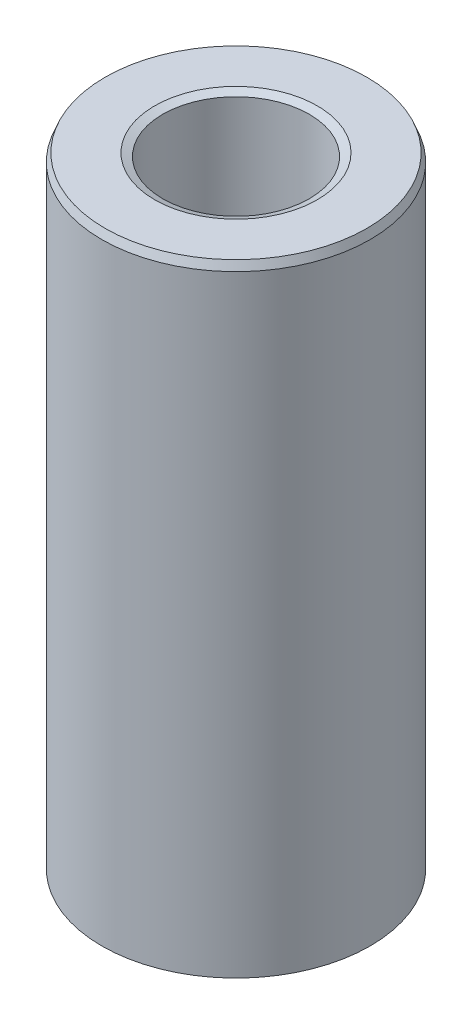
ISO-10303-21;
HEADER;
FILE_DESCRIPTION(('STEP AP214'),'2;1');
FILE_NAME('part.step','',(''),(''),'','','');
FILE_SCHEMA(('AUTOMOTIVE_DESIGN { 1 0 10303 214 1 1 1 1 }'));
ENDSEC;
DATA;
#1=APPLICATION_CONTEXT('core data for automotive mechanical design processes');
#2=APPLICATION_PROTOCOL_DEFINITION('international standard','automotive_design',2000,#1);
#3=PRODUCT_CONTEXT('',#1,'mechanical');
#4=PRODUCT('Part','Part','',(#3));
#5=PRODUCT_RELATED_PRODUCT_CATEGORY('part','',(#4));
#6=PRODUCT_DEFINITION_FORMATION('','',#4);
#7=PRODUCT_DEFINITION_CONTEXT('part definition',#1,'design');
#8=PRODUCT_DEFINITION('design','',#6,#7);
#9=PRODUCT_DEFINITION_SHAPE('','',#8);
#10=(LENGTH_UNIT() NAMED_UNIT(*) SI_UNIT(.MILLI.,.METRE.));
#11=(NAMED_UNIT(*) PLANE_ANGLE_UNIT() SI_UNIT($,.RADIAN.));
#12=(NAMED_UNIT(*) SI_UNIT($,.STERADIAN.) SOLID_ANGLE_UNIT());
#13=UNCERTAINTY_MEASURE_WITH_UNIT(LENGTH_MEASURE(1.E-05),#10,'distance_accuracy_value','');
#14=(GEOMETRIC_REPRESENTATION_CONTEXT(3) GLOBAL_UNCERTAINTY_ASSIGNED_CONTEXT((#13)) GLOBAL_UNIT_ASSIGNED_CONTEXT((#10,
#11,#12)) REPRESENTATION_CONTEXT('',''));
#15=CARTESIAN_POINT('',(0.,0.,0.));
#16=DIRECTION('',(0.,0.,1.));
#17=DIRECTION('',(1.,0.,0.));
#18=AXIS2_PLACEMENT_3D('',#15,#16,#17);
#19=CARTESIAN_POINT('',(0.,58.0610249584416,0.));
#20=DIRECTION('',(0.,-1.,0.));
#21=DIRECTION('',(0.,0.,-1.));
#22=AXIS2_PLACEMENT_3D('',#19,#20,#21);
#23=CYLINDRICAL_SURFACE('',#22,12.5);
#24=CARTESIAN_POINT('',(0.,0.300780208003594,0.));
#25=DIRECTION('',(0.,1.,0.));
#26=DIRECTION('',(0.,0.,1.));
#27=AXIS2_PLACEMENT_3D('',#24,#25,#26);
#28=CIRCLE('',#27,12.5);
#29=CARTESIAN_POINT('',(0.,0.300780208003587,-12.5));
#30=VERTEX_POINT('',#29);
#31=EDGE_CURVE('E10',#30,#30,#28,.T.);
#32=CARTESIAN_POINT('',(0.,57.3058540872116,0.));
#33=DIRECTION('',(0.,1.,0.));
#34=DIRECTION('',(0.,0.,1.));
#35=AXIS2_PLACEMENT_3D('',#32,#33,#34);
#36=CIRCLE('',#35,12.5);
#37=CARTESIAN_POINT('',(0.,57.3058540872116,-12.5));
#38=VERTEX_POINT('',#37);
#39=EDGE_CURVE('E50',#38,#38,#36,.F.);
#40=CARTESIAN_POINT('',(0.,0.300780208003587,-12.5));
#41=CARTESIAN_POINT('',(0.,0.894583060912004,-12.5));
#42=CARTESIAN_POINT('',(0.,1.48838591382042,-12.5));
#43=CARTESIAN_POINT('',(0.,2.67599161963725,-12.5));
#44=CARTESIAN_POINT('',(0.,3.26979447254567,-12.5));
#45=CARTESIAN_POINT('',(0.,4.4574001783625,-12.5));
#46=CARTESIAN_POINT('',(0.,5.05120303127092,-12.5));
#47=CARTESIAN_POINT('',(0.,6.23880873708775,-12.5));
#48=CARTESIAN_POINT('',(0.,6.83261158999617,-12.5));
#49=CARTESIAN_POINT('',(0.,8.020217295813,-12.5));
#50=CARTESIAN_POINT('',(0.,8.61402014872142,-12.5));
#51=CARTESIAN_POINT('',(0.,9.80162585453825,-12.5));
#52=CARTESIAN_POINT('',(0.,10.3954287074467,-12.5));
#53=CARTESIAN_POINT('',(0.,11.5830344132635,-12.5));
#54=CARTESIAN_POINT('',(0.,12.1768372661719,-12.5));
#55=CARTESIAN_POINT('',(0.,13.3644429719887,-12.5));
#56=CARTESIAN_POINT('',(0.,13.9582458248972,-12.5));
#57=CARTESIAN_POINT('',(0.,15.145851530714,-12.5));
#58=CARTESIAN_POINT('',(0.,15.7396543836224,-12.5));
#59=CARTESIAN_POINT('',(0.,16.9272600894392,-12.5));
#60=CARTESIAN_POINT('',(0.,17.5210629423477,-12.5));
#61=CARTESIAN_POINT('',(0.,18.7086686481645,-12.5));
#62=CARTESIAN_POINT('',(0.,19.3024715010729,-12.5));
#63=CARTESIAN_POINT('',(0.,20.4900772068897,-12.5));
#64=CARTESIAN_POINT('',(0.,21.0838800597982,-12.5));
#65=CARTESIAN_POINT('',(0.,22.271485765615,-12.5));
#66=CARTESIAN_POINT('',(0.,22.8652886185234,-12.5));
#67=CARTESIAN_POINT('',(0.,24.0528943243402,-12.5));
#68=CARTESIAN_POINT('',(0.,24.6466971772487,-12.5));
#69=CARTESIAN_POINT('',(0.,25.8343028830655,-12.5));
#70=CARTESIAN_POINT('',(0.,26.4281057359739,-12.5));
#71=CARTESIAN_POINT('',(0.,27.6157114417907,-12.5));
#72=CARTESIAN_POINT('',(0.,28.2095142946992,-12.5));
#73=CARTESIAN_POINT('',(0.,29.397120000516,-12.5));
#74=CARTESIAN_POINT('',(0.,29.9909228534244,-12.5));
#75=CARTESIAN_POINT('',(0.,31.1785285592412,-12.5));
#76=CARTESIAN_POINT('',(0.,31.7723314121496,-12.5));
#77=CARTESIAN_POINT('',(0.,32.9599371179665,-12.5));
#78=CARTESIAN_POINT('',(0.,33.5537399708749,-12.5));
#79=CARTESIAN_POINT('',(0.,34.7413456766917,-12.5));
#80=CARTESIAN_POINT('',(0.,35.3351485296002,-12.5));
#81=CARTESIAN_POINT('',(0.,36.522754235417,-12.5));
#82=CARTESIAN_POINT('',(0.,37.1165570883254,-12.5));
#83=CARTESIAN_POINT('',(0.,38.3041627941422,-12.5));
#84=CARTESIAN_POINT('',(0.,38.8979656470506,-12.5));
#85=CARTESIAN_POINT('',(0.,40.0855713528675,-12.5));
#86=CARTESIAN_POINT('',(0.,40.6793742057759,-12.5));
#87=CARTESIAN_POINT('',(0.,41.8669799115927,-12.5));
#88=CARTESIAN_POINT('',(0.,42.4607827645011,-12.5));
#89=CARTESIAN_POINT('',(0.,43.648388470318,-12.5));
#90=CARTESIAN_POINT('',(0.,44.2421913232264,-12.5));
#91=CARTESIAN_POINT('',(0.,45.4297970290432,-12.5));
#92=CARTESIAN_POINT('',(0.,46.0235998819516,-12.5));
#93=CARTESIAN_POINT('',(0.,47.2112055877685,-12.5));
#94=CARTESIAN_POINT('',(0.,47.8050084406769,-12.5));
#95=CARTESIAN_POINT('',(0.,48.9926141464937,-12.5));
#96=CARTESIAN_POINT('',(0.,49.5864169994021,-12.5));
#97=CARTESIAN_POINT('',(0.,50.774022705219,-12.5));
#98=CARTESIAN_POINT('',(0.,51.3678255581274,-12.5));
#99=CARTESIAN_POINT('',(0.,52.5554312639442,-12.5));
#100=CARTESIAN_POINT('',(0.,53.1492341168526,-12.5));
#101=CARTESIAN_POINT('',(0.,54.3368398226695,-12.5));
#102=CARTESIAN_POINT('',(0.,54.9306426755779,-12.5));
#103=CARTESIAN_POINT('',(0.,56.1182483813947,-12.5));
#104=CARTESIAN_POINT('',(0.,56.7120512343031,-12.5));
#105=CARTESIAN_POINT('',(0.,57.3058540872116,-12.5));
#106=B_SPLINE_CURVE_WITH_KNOTS('',3,(#40,#41,#42,#43,#44,#45,#46,#47,#48,#49,#50,#51,#52,#53,
#54,#55,#56,#57,#58,#59,#60,#61,#62,#63,#64,#65,#66,#67,#68,#69,#70,#71,#72,#73,#74,#75,#76,#77,
#78,#79,#80,#81,#82,#83,#84,#85,#86,#87,#88,#89,#90,#91,#92,#93,#94,#95,#96,#97,#98,#99,#100,
#101,#102,#103,#104,#105),.UNSPECIFIED.,.F.,.F.,(4,2,2,2,2,2,2,2,2,2,2,2,2,2,2,2,2,2,2,2,2,2,2,
2,2,2,2,2,2,2,2,2,4),(0.,1.78140855872525,3.5628171174505,5.34422567617575,7.12563423490099,
8.90704279362624,10.6884513523515,12.4698599110767,14.251268469802,16.0326770285272,
17.8140855872525,19.5954941459777,21.376902704703,23.1583112634282,24.9397198221535,
26.7211283808787,28.502536939604,30.2839454983292,32.0653540570545,33.8467626157797,
35.628171174505,37.4095797332302,39.1909882919555,40.9723968506807,42.753805409406,
44.5352139681312,46.3166225268565,48.0980310855817,49.879439644307,51.6608482030322,
53.4422567617575,55.2236653204827,57.005073879208),.UNSPECIFIED.);
#107=EDGE_CURVE('BSEAM39',#30,#38,#106,.T.);
#108=ORIENTED_EDGE('',*,*,#31,.T.);
#109=ORIENTED_EDGE('',*,*,#39,.T.);
#110=ORIENTED_EDGE('',*,*,#107,.T.);
#111=ORIENTED_EDGE('',*,*,#107,.F.);
#112=EDGE_LOOP('',(#108,#110,#109,#111));
#113=FACE_BOUND('',#112,.T.);
#114=ADVANCED_FACE('F39',(#113),#23,.T.);
#115=CARTESIAN_POINT('',(0.,58.0610249584416,0.));
#116=DIRECTION('',(0.,1.,0.));
#117=DIRECTION('',(0.,0.,1.));
#118=AXIS2_PLACEMENT_3D('',#115,#116,#117);
#119=PLANE('',#118);
#120=CARTESIAN_POINT('',(0.,58.0610249584416,0.));
#121=DIRECTION('',(0.,1.,0.));
#122=DIRECTION('',(0.,0.,1.));
#123=AXIS2_PLACEMENT_3D('',#120,#121,#122);
#124=CIRCLE('',#123,7.5809836617257);
#125=CARTESIAN_POINT('',(0.,58.0610249584416,7.5809836617257));
#126=VERTEX_POINT('',#125);
#127=EDGE_CURVE('E58',#126,#126,#124,.F.);
#128=ORIENTED_EDGE('',*,*,#127,.T.);
#129=EDGE_LOOP('',(#128));
#130=FACE_BOUND('',#129,.T.);
#131=CARTESIAN_POINT('',(0.,58.0610249584416,0.));
#132=DIRECTION('',(0.,1.,0.));
#133=DIRECTION('',(0.,0.,1.));
#134=AXIS2_PLACEMENT_3D('',#131,#132,#133);
#135=CIRCLE('',#134,12.1992197919965);
#136=CARTESIAN_POINT('',(0.,58.0610249584416,12.1992197919965));
#137=VERTEX_POINT('',#136);
#138=EDGE_CURVE('E61',#137,#137,#135,.T.);
#139=ORIENTED_EDGE('',*,*,#138,.T.);
#140=EDGE_LOOP('',(#139));
#141=FACE_BOUND('',#140,.T.);
#142=ADVANCED_FACE('F88',(#130,#141),#119,.T.);
#143=CARTESIAN_POINT('',(0.,0.,0.));
#144=DIRECTION('',(0.,1.,0.));
#145=DIRECTION('',(0.,0.,1.));
#146=AXIS2_PLACEMENT_3D('',#143,#144,#145);
#147=PLANE('',#146);
#148=CARTESIAN_POINT('',(0.,0.,0.));
#149=DIRECTION('',(0.,1.,0.));
#150=DIRECTION('',(0.,0.,1.));
#151=AXIS2_PLACEMENT_3D('',#148,#149,#150);
#152=CIRCLE('',#151,7.12659299849902);
#153=CARTESIAN_POINT('',(0.,0.,-7.12659299849902));
#154=VERTEX_POINT('',#153);
#155=EDGE_CURVE('E51',#154,#154,#152,.T.);
#156=ORIENTED_EDGE('',*,*,#155,.T.);
#157=EDGE_LOOP('',(#156));
#158=FACE_BOUND('',#157,.T.);
#159=CARTESIAN_POINT('',(0.,0.,0.));
#160=DIRECTION('',(0.,1.,0.));
#161=DIRECTION('',(0.,0.,1.));
#162=AXIS2_PLACEMENT_3D('',#159,#160,#161);
#163=CIRCLE('',#162,11.7448291287697);
#164=CARTESIAN_POINT('',(0.,0.,11.7448291287697));
#165=VERTEX_POINT('',#164);
#166=EDGE_CURVE('E54',#165,#165,#163,.F.);
#167=ORIENTED_EDGE('',*,*,#166,.T.);
#168=EDGE_LOOP('',(#167));
#169=FACE_BOUND('',#168,.T.);
#170=ADVANCED_FACE('F83',(#158,#169),#147,.F.);
#171=CARTESIAN_POINT('',(0.,58.0610249584416,0.));
#172=DIRECTION('',(0.,-1.,0.));
#173=DIRECTION('',(0.,0.,-1.));
#174=AXIS2_PLACEMENT_3D('',#171,#172,#173);
#175=CYLINDRICAL_SURFACE('',#174,6.82581279049546);
#176=CARTESIAN_POINT('',(0.,57.760244750438,0.));
#177=DIRECTION('',(0.,1.,0.));
#178=DIRECTION('',(0.,0.,1.));
#179=AXIS2_PLACEMENT_3D('',#176,#177,#178);
#180=CIRCLE('',#179,6.82581279049546);
#181=CARTESIAN_POINT('',(0.,57.760244750438,-6.82581279049546));
#182=VERTEX_POINT('',#181);
#183=EDGE_CURVE('E67',#182,#182,#180,.T.);
#184=CARTESIAN_POINT('',(0.,0.755170871230199,0.));
#185=DIRECTION('',(0.,1.,0.));
#186=DIRECTION('',(0.,0.,1.));
#187=AXIS2_PLACEMENT_3D('',#184,#185,#186);
#188=CIRCLE('',#187,6.82581279049546);
#189=CARTESIAN_POINT('',(0.,0.755170871230199,-6.82581279049546));
#190=VERTEX_POINT('',#189);
#191=EDGE_CURVE('E69',#190,#190,#188,.F.);
#192=CARTESIAN_POINT('',(0.,57.760244750438,-6.82581279049546));
#193=CARTESIAN_POINT('',(0.,57.1664418975296,-6.82581279049546));
#194=CARTESIAN_POINT('',(0.,56.5726390446212,-6.82581279049546));
#195=CARTESIAN_POINT('',(0.,55.3850333388044,-6.82581279049546));
#196=CARTESIAN_POINT('',(0.,54.791230485896,-6.82581279049546));
#197=CARTESIAN_POINT('',(0.,53.6036247800791,-6.82581279049546));
#198=CARTESIAN_POINT('',(0.,53.0098219271707,-6.82581279049546));
#199=CARTESIAN_POINT('',(0.,51.8222162213539,-6.82581279049546));
#200=CARTESIAN_POINT('',(0.,51.2284133684455,-6.82581279049546));
#201=CARTESIAN_POINT('',(0.,50.0408076626286,-6.82581279049546));
#202=CARTESIAN_POINT('',(0.,49.4470048097202,-6.82581279049546));
#203=CARTESIAN_POINT('',(0.,48.2593991039034,-6.82581279049546));
#204=CARTESIAN_POINT('',(0.,47.665596250995,-6.82581279049546));
#205=CARTESIAN_POINT('',(0.,46.4779905451782,-6.82581279049546));
#206=CARTESIAN_POINT('',(0.,45.8841876922697,-6.82581279049546));
#207=CARTESIAN_POINT('',(0.,44.6965819864529,-6.82581279049546));
#208=CARTESIAN_POINT('',(0.,44.1027791335445,-6.82581279049546));
#209=CARTESIAN_POINT('',(0.,42.9151734277277,-6.82581279049546));
#210=CARTESIAN_POINT('',(0.,42.3213705748193,-6.82581279049546));
#211=CARTESIAN_POINT('',(0.,41.1337648690024,-6.82581279049546));
#212=CARTESIAN_POINT('',(0.,40.539962016094,-6.82581279049546));
#213=CARTESIAN_POINT('',(0.,39.3523563102772,-6.82581279049546));
#214=CARTESIAN_POINT('',(0.,38.7585534573688,-6.82581279049546));
#215=CARTESIAN_POINT('',(0.,37.5709477515519,-6.82581279049546));
#216=CARTESIAN_POINT('',(0.,36.9771448986435,-6.82581279049546));
#217=CARTESIAN_POINT('',(0.,35.7895391928267,-6.82581279049546));
#218=CARTESIAN_POINT('',(0.,35.1957363399183,-6.82581279049546));
#219=CARTESIAN_POINT('',(0.,34.0081306341014,-6.82581279049546));
#220=CARTESIAN_POINT('',(0.,33.414327781193,-6.82581279049546));
#221=CARTESIAN_POINT('',(0.,32.2267220753762,-6.82581279049546));
#222=CARTESIAN_POINT('',(0.,31.6329192224678,-6.82581279049546));
#223=CARTESIAN_POINT('',(0.,30.445313516651,-6.82581279049546));
#224=CARTESIAN_POINT('',(0.,29.8515106637425,-6.82581279049546));
#225=CARTESIAN_POINT('',(0.,28.6639049579257,-6.82581279049546));
#226=CARTESIAN_POINT('',(0.,28.0701021050173,-6.82581279049546));
#227=CARTESIAN_POINT('',(0.,26.8824963992005,-6.82581279049546));
#228=CARTESIAN_POINT('',(0.,26.288693546292,-6.82581279049546));
#229=CARTESIAN_POINT('',(0.,25.1010878404752,-6.82581279049546));
#230=CARTESIAN_POINT('',(0.,24.5072849875668,-6.82581279049546));
#231=CARTESIAN_POINT('',(0.,23.31967928175,-6.82581279049546));
#232=CARTESIAN_POINT('',(0.,22.7258764288416,-6.82581279049546));
#233=CARTESIAN_POINT('',(0.,21.5382707230247,-6.82581279049546));
#234=CARTESIAN_POINT('',(0.,20.9444678701163,-6.82581279049546));
#235=CARTESIAN_POINT('',(0.,19.7568621642995,-6.82581279049546));
#236=CARTESIAN_POINT('',(0.,19.1630593113911,-6.82581279049546));
#237=CARTESIAN_POINT('',(0.,17.9754536055742,-6.82581279049546));
#238=CARTESIAN_POINT('',(0.,17.3816507526658,-6.82581279049546));
#239=CARTESIAN_POINT('',(0.,16.194045046849,-6.82581279049546));
#240=CARTESIAN_POINT('',(0.,15.6002421939406,-6.82581279049546));
#241=CARTESIAN_POINT('',(0.,14.4126364881237,-6.82581279049546));
#242=CARTESIAN_POINT('',(0.,13.8188336352153,-6.82581279049546));
#243=CARTESIAN_POINT('',(0.,12.6312279293985,-6.82581279049546));
#244=CARTESIAN_POINT('',(0.,12.0374250764901,-6.82581279049546));
#245=CARTESIAN_POINT('',(0.,10.8498193706733,-6.82581279049546));
#246=CARTESIAN_POINT('',(0.,10.2560165177648,-6.82581279049546));
#247=CARTESIAN_POINT('',(0.,9.06841081194801,-6.82581279049546));
#248=CARTESIAN_POINT('',(0.,8.47460795903959,-6.82581279049546));
#249=CARTESIAN_POINT('',(0.,7.28700225322276,-6.82581279049546));
#250=CARTESIAN_POINT('',(0.,6.69319940031435,-6.82581279049546));
#251=CARTESIAN_POINT('',(0.,5.50559369449752,-6.82581279049546));
#252=CARTESIAN_POINT('',(0.,4.9117908415891,-6.82581279049546));
#253=CARTESIAN_POINT('',(0.,3.72418513577227,-6.82581279049546));
#254=CARTESIAN_POINT('',(0.,3.13038228286386,-6.82581279049546));
#255=CARTESIAN_POINT('',(0.,1.94277657704703,-6.82581279049546));
#256=CARTESIAN_POINT('',(0.,1.34897372413861,-6.82581279049546));
#257=CARTESIAN_POINT('',(0.,0.755170871230199,-6.82581279049546));
#258=B_SPLINE_CURVE_WITH_KNOTS('',3,(#192,#193,#194,#195,#196,#197,#198,#199,#200,#201,#202,
#203,#204,#205,#206,#207,#208,#209,#210,#211,#212,#213,#214,#215,#216,#217,#218,#219,#220,#221,
#222,#223,#224,#225,#226,#227,#228,#229,#230,#231,#232,#233,#234,#235,#236,#237,#238,#239,#240,
#241,#242,#243,#244,#245,#246,#247,#248,#249,#250,#251,#252,#253,#254,#255,#256,#257),
.UNSPECIFIED.,.F.,.F.,(4,2,2,2,2,2,2,2,2,2,2,2,2,2,2,2,2,2,2,2,2,2,2,2,2,2,2,2,2,2,2,2,4),(0.,
1.78140855872524,3.56281711745049,5.34422567617573,7.12563423490098,8.90704279362622,
10.6884513523515,12.4698599110767,14.251268469802,16.0326770285272,17.8140855872524,
19.5954941459777,21.3769027047029,23.1583112634282,24.9397198221534,26.7211283808787,
28.5025369396039,30.2839454983292,32.0653540570544,33.8467626157797,35.6281711745049,
37.4095797332301,39.1909882919554,40.9723968506806,42.7538054094059,44.5352139681311,
46.3166225268564,48.0980310855816,49.8794396443069,51.6608482030321,53.4422567617573,
55.2236653204826,57.0050738792078),.UNSPECIFIED.);
#259=EDGE_CURVE('BSEAM71',#182,#190,#258,.T.);
#260=ORIENTED_EDGE('',*,*,#183,.T.);
#261=ORIENTED_EDGE('',*,*,#191,.T.);
#262=ORIENTED_EDGE('',*,*,#259,.T.);
#263=ORIENTED_EDGE('',*,*,#259,.F.);
#264=EDGE_LOOP('',(#260,#262,#261,#263));
#265=FACE_BOUND('',#264,.T.);
#266=ADVANCED_FACE('F71',(#265),#175,.F.);
#267=CARTESIAN_POINT('',(0.,57.760244750438,0.));
#268=DIRECTION('',(0.,1.,0.));
#269=DIRECTION('',(0.,0.,1.));
#270=AXIS2_PLACEMENT_3D('',#267,#268,#269);
#271=CONICAL_SURFACE('',#270,6.82581279049546,1.19176129707135);
#272=ORIENTED_EDGE('',*,*,#127,.F.);
#273=EDGE_LOOP('',(#272));
#274=FACE_BOUND('',#273,.T.);
#275=ORIENTED_EDGE('',*,*,#183,.F.);
#276=EDGE_LOOP('',(#275));
#277=FACE_BOUND('',#276,.T.);
#278=ADVANCED_FACE('F77',(#274,#277),#271,.F.);
#279=CARTESIAN_POINT('',(0.,0.,0.));
#280=DIRECTION('',(0.,-1.,0.));
#281=DIRECTION('',(0.,0.,-1.));
#282=AXIS2_PLACEMENT_3D('',#279,#280,#281);
#283=CONICAL_SURFACE('',#282,7.12659299849902,0.37903502972354);
#284=CARTESIAN_POINT('',(0.,0.755170871230198,-6.82581279049546));
#285=CARTESIAN_POINT('',(0.,0.747304507988217,-6.82894591766216));
#286=CARTESIAN_POINT('',(0.,0.739438144746236,-6.83207904482886));
#287=CARTESIAN_POINT('',(0.,0.723705418262274,-6.83834529916227));
#288=CARTESIAN_POINT('',(0.,0.715839055020292,-6.84147842632898));
#289=CARTESIAN_POINT('',(0.,0.70010632853633,-6.84774468066238));
#290=CARTESIAN_POINT('',(0.,0.692239965294349,-6.85087780782909));
#291=CARTESIAN_POINT('',(0.,0.676507238810386,-6.8571440621625));
#292=CARTESIAN_POINT('',(0.,0.668640875568405,-6.8602771893292));
#293=CARTESIAN_POINT('',(0.,0.652908149084442,-6.86654344366261));
#294=CARTESIAN_POINT('',(0.,0.645041785842461,-6.86967657082931));
#295=CARTESIAN_POINT('',(0.,0.629309059358499,-6.87594282516272));
#296=CARTESIAN_POINT('',(0.,0.621442696116517,-6.87907595232942));
#297=CARTESIAN_POINT('',(0.,0.605709969632555,-6.88534220666283));
#298=CARTESIAN_POINT('',(0.,0.597843606390574,-6.88847533382953));
#299=CARTESIAN_POINT('',(0.,0.582110879906611,-6.89474158816294));
#300=CARTESIAN_POINT('',(0.,0.57424451666463,-6.89787471532964));
#301=CARTESIAN_POINT('',(0.,0.558511790180668,-6.90414096966305));
#302=CARTESIAN_POINT('',(0.,0.550645426938686,-6.90727409682976));
#303=CARTESIAN_POINT('',(0.,0.534912700454724,-6.91354035116316));
#304=CARTESIAN_POINT('',(0.,0.527046337212743,-6.91667347832987));
#305=CARTESIAN_POINT('',(0.,0.51131361072878,-6.92293973266328));
#306=CARTESIAN_POINT('',(0.,0.503447247486799,-6.92607285982998));
#307=CARTESIAN_POINT('',(0.,0.487714521002836,-6.93233911416339));
#308=CARTESIAN_POINT('',(0.,0.479848157760855,-6.93547224133009));
#309=CARTESIAN_POINT('',(0.,0.464115431276893,-6.9417384956635));
#310=CARTESIAN_POINT('',(0.,0.456249068034911,-6.9448716228302));
#311=CARTESIAN_POINT('',(0.,0.440516341550949,-6.95113787716361));
#312=CARTESIAN_POINT('',(0.,0.432649978308968,-6.95427100433031));
#313=CARTESIAN_POINT('',(0.,0.416917251825005,-6.96053725866372));
#314=CARTESIAN_POINT('',(0.,0.409050888583024,-6.96367038583042));
#315=CARTESIAN_POINT('',(0.,0.393318162099062,-6.96993664016383));
#316=CARTESIAN_POINT('',(0.,0.38545179885708,-6.97306976733054));
#317=CARTESIAN_POINT('',(0.,0.369719072373118,-6.97933602166394));
#318=CARTESIAN_POINT('',(0.,0.361852709131137,-6.98246914883065));
#319=CARTESIAN_POINT('',(0.,0.346119982647174,-6.98873540316406));
#320=CARTESIAN_POINT('',(0.,0.338253619405193,-6.99186853033076));
#321=CARTESIAN_POINT('',(0.,0.322520892921231,-6.99813478466417));
#322=CARTESIAN_POINT('',(0.,0.314654529679249,-7.00126791183087));
#323=CARTESIAN_POINT('',(0.,0.298921803195287,-7.00753416616428));
#324=CARTESIAN_POINT('',(0.,0.291055439953306,-7.01066729333098));
#325=CARTESIAN_POINT('',(0.,0.275322713469343,-7.01693354766439));
#326=CARTESIAN_POINT('',(0.,0.267456350227362,-7.02006667483109));
#327=CARTESIAN_POINT('',(0.,0.251723623743399,-7.0263329291645));
#328=CARTESIAN_POINT('',(0.,0.243857260501418,-7.0294660563312));
#329=CARTESIAN_POINT('',(0.,0.228124534017456,-7.03573231066461));
#330=CARTESIAN_POINT('',(0.,0.220258170775475,-7.03886543783132));
#331=CARTESIAN_POINT('',(0.,0.204525444291512,-7.04513169216472));
#332=CARTESIAN_POINT('',(0.,0.196659081049531,-7.04826481933143));
#333=CARTESIAN_POINT('',(0.,0.180926354565568,-7.05453107366484));
#334=CARTESIAN_POINT('',(0.,0.173059991323587,-7.05766420083154));
#335=CARTESIAN_POINT('',(0.,0.157327264839625,-7.06393045516495));
#336=CARTESIAN_POINT('',(0.,0.149460901597643,-7.06706358233165));
#337=CARTESIAN_POINT('',(0.,0.133728175113681,-7.07332983666506));
#338=CARTESIAN_POINT('',(0.,0.1258618118717,-7.07646296383176));
#339=CARTESIAN_POINT('',(0.,0.110129085387737,-7.08272921816517));
#340=CARTESIAN_POINT('',(0.,0.102262722145756,-7.08586234533187));
#341=CARTESIAN_POINT('',(0.,0.0865299956617936,-7.09212859966528));
#342=CARTESIAN_POINT('',(0.,0.0786636324198123,-7.09526172683198));
#343=CARTESIAN_POINT('',(0.,0.0629309059358498,-7.10152798116539));
#344=CARTESIAN_POINT('',(0.,0.0550645426938687,-7.1046611083321));
#345=CARTESIAN_POINT('',(0.,0.0393318162099062,-7.1109273626655));
#346=CARTESIAN_POINT('',(0.,0.031465452967925,-7.11406048983221));
#347=CARTESIAN_POINT('',(0.,0.0157327264839624,-7.12032674416562));
#348=CARTESIAN_POINT('',(0.,0.00786636324198116,-7.12345987133232));
#349=CARTESIAN_POINT('',(0.,0.,-7.12659299849902));
#350=B_SPLINE_CURVE_WITH_KNOTS('',3,(#284,#285,#286,#287,#288,#289,#290,#291,#292,#293,#294,
#295,#296,#297,#298,#299,#300,#301,#302,#303,#304,#305,#306,#307,#308,#309,#310,#311,#312,#313,
#314,#315,#316,#317,#318,#319,#320,#321,#322,#323,#324,#325,#326,#327,#328,#329,#330,#331,#332,
#333,#334,#335,#336,#337,#338,#339,#340,#341,#342,#343,#344,#345,#346,#347,#348,#349),
.UNSPECIFIED.,.F.,.F.,(4,2,2,2,2,2,2,2,2,2,2,2,2,2,2,2,2,2,2,2,2,2,2,2,2,2,2,2,2,2,2,2,4),(0.,
0.0254020748852879,0.0508041497705761,0.0762062246558641,0.101608299541152,0.12701037442644,
0.152412449311728,0.177814524197016,0.203216599082304,0.228618673967592,0.25402074885288,
0.279422823738168,0.304824898623456,0.330226973508744,0.355629048394032,0.38103112327932,
0.406433198164608,0.431835273049896,0.457237347935184,0.482639422820472,0.50804149770576,
0.533443572591048,0.558845647476336,0.584247722361624,0.609649797246912,0.6350518721322,
0.660453947017488,0.685856021902776,0.711258096788064,0.736660171673352,0.76206224655864,
0.787464321443928,0.812866396329216),.UNSPECIFIED.);
#351=EDGE_CURVE('BSEAM73',#190,#154,#350,.T.);
#352=ORIENTED_EDGE('',*,*,#191,.F.);
#353=ORIENTED_EDGE('',*,*,#155,.F.);
#354=ORIENTED_EDGE('',*,*,#351,.T.);
#355=ORIENTED_EDGE('',*,*,#351,.F.);
#356=EDGE_LOOP('',(#352,#354,#353,#355));
#357=FACE_BOUND('',#356,.T.);
#358=ADVANCED_FACE('F73',(#357),#283,.F.);
#359=CARTESIAN_POINT('',(0.,0.300780208003594,0.));
#360=DIRECTION('',(0.,1.,0.));
#361=DIRECTION('',(0.,0.,1.));
#362=AXIS2_PLACEMENT_3D('',#359,#360,#361);
#363=CONICAL_SURFACE('',#362,12.5,1.19176129707135);
#364=ORIENTED_EDGE('',*,*,#166,.F.);
#365=EDGE_LOOP('',(#364));
#366=FACE_BOUND('',#365,.T.);
#367=ORIENTED_EDGE('',*,*,#31,.F.);
#368=EDGE_LOOP('',(#367));
#369=FACE_BOUND('',#368,.T.);
#370=ADVANCED_FACE('F76',(#366,#369),#363,.T.);
#371=CARTESIAN_POINT('',(0.,58.0610249584416,0.));
#372=DIRECTION('',(0.,-1.,0.));
#373=DIRECTION('',(0.,0.,-1.));
#374=AXIS2_PLACEMENT_3D('',#371,#372,#373);
#375=CONICAL_SURFACE('',#374,12.1992197919965,0.379035029723547);
#376=ORIENTED_EDGE('',*,*,#39,.F.);
#377=EDGE_LOOP('',(#376));
#378=FACE_BOUND('',#377,.T.);
#379=ORIENTED_EDGE('',*,*,#138,.F.);
#380=EDGE_LOOP('',(#379));
#381=FACE_BOUND('',#380,.T.);
#382=ADVANCED_FACE('F45',(#378,#381),#375,.T.);
#383=CLOSED_SHELL('',(#114,#142,#170,#266,#278,#358,#370,#382));
#384=MANIFOLD_SOLID_BREP('B2',#383);
#385=ADVANCED_BREP_SHAPE_REPRESENTATION('',(#18,#384),#14);
#386=SHAPE_DEFINITION_REPRESENTATION(#9,#385);
ENDSEC;
END-ISO-10303-21;
